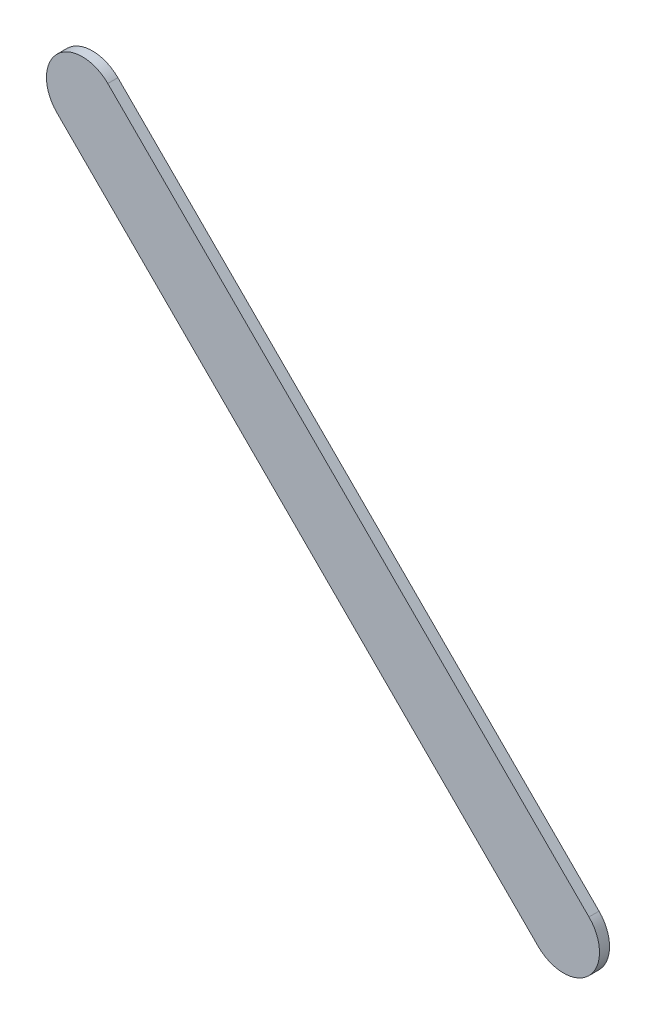
ISO-10303-21;
HEADER;
FILE_DESCRIPTION(('STEP AP214'),'2;1');
FILE_NAME('part.step','',(''),(''),'','','');
FILE_SCHEMA(('AUTOMOTIVE_DESIGN { 1 0 10303 214 1 1 1 1 }'));
ENDSEC;
DATA;
#1=APPLICATION_CONTEXT('core data for automotive mechanical design processes');
#2=APPLICATION_PROTOCOL_DEFINITION('international standard','automotive_design',2000,#1);
#3=PRODUCT_CONTEXT('',#1,'mechanical');
#4=PRODUCT('Part','Part','',(#3));
#5=PRODUCT_RELATED_PRODUCT_CATEGORY('part','',(#4));
#6=PRODUCT_DEFINITION_FORMATION('','',#4);
#7=PRODUCT_DEFINITION_CONTEXT('part definition',#1,'design');
#8=PRODUCT_DEFINITION('design','',#6,#7);
#9=PRODUCT_DEFINITION_SHAPE('','',#8);
#10=(LENGTH_UNIT() NAMED_UNIT(*) SI_UNIT(.MILLI.,.METRE.));
#11=(NAMED_UNIT(*) PLANE_ANGLE_UNIT() SI_UNIT($,.RADIAN.));
#12=(NAMED_UNIT(*) SI_UNIT($,.STERADIAN.) SOLID_ANGLE_UNIT());
#13=UNCERTAINTY_MEASURE_WITH_UNIT(LENGTH_MEASURE(1.E-05),#10,'distance_accuracy_value','');
#14=(GEOMETRIC_REPRESENTATION_CONTEXT(3) GLOBAL_UNCERTAINTY_ASSIGNED_CONTEXT((#13)) GLOBAL_UNIT_ASSIGNED_CONTEXT((#10,
#11,#12)) REPRESENTATION_CONTEXT('',''));
#15=CARTESIAN_POINT('',(0.,0.,0.));
#16=DIRECTION('',(0.,0.,1.));
#17=DIRECTION('',(1.,0.,0.));
#18=AXIS2_PLACEMENT_3D('',#15,#16,#17);
#19=CARTESIAN_POINT('',(98.3271719,97.59717082,0.));
#20=DIRECTION('',(0.707106781186548,0.707106781186548,0.));
#21=DIRECTION('',(0.707106781186548,-0.707106781186548,0.));
#22=AXIS2_PLACEMENT_3D('',#19,#20,#21);
#23=PLANE('',#22);
#24=DIRECTION('',(0.707106781186548,-0.707106781186548,0.));
#25=VECTOR('',#24,1.);
#26=CARTESIAN_POINT('',(98.3271719,97.59717082,0.03556));
#27=LINE('',#26,#25);
#28=CARTESIAN_POINT('',(98.3271719,97.59717082,0.03556));
#29=VERTEX_POINT('',#28);
#30=CARTESIAN_POINT('',(100.02717104,95.89717168,0.03556));
#31=VERTEX_POINT('',#30);
#32=EDGE_CURVE('E11',#29,#31,#27,.T.);
#33=ORIENTED_EDGE('',*,*,#32,.F.);
#34=DIRECTION('',(0.,0.,1.));
#35=VECTOR('',#34,1.);
#36=CARTESIAN_POINT('',(98.3271719,97.59717082,0.));
#37=LINE('',#36,#35);
#38=CARTESIAN_POINT('',(98.3271719,97.59717082,0.));
#39=VERTEX_POINT('',#38);
#40=EDGE_CURVE('E24',#39,#29,#37,.T.);
#41=ORIENTED_EDGE('',*,*,#40,.F.);
#42=DIRECTION('',(0.707106781186548,-0.707106781186548,0.));
#43=VECTOR('',#42,1.);
#44=CARTESIAN_POINT('',(98.3271719,97.59717082,0.));
#45=LINE('',#44,#43);
#46=CARTESIAN_POINT('',(100.02717104,95.89717168,0.));
#47=VERTEX_POINT('',#46);
#48=EDGE_CURVE('E75',#39,#47,#45,.T.);
#49=ORIENTED_EDGE('',*,*,#48,.T.);
#50=DIRECTION('',(0.,0.,1.));
#51=VECTOR('',#50,1.);
#52=CARTESIAN_POINT('',(100.02717104,95.89717168,0.));
#53=LINE('',#52,#51);
#54=EDGE_CURVE('E37',#47,#31,#53,.T.);
#55=ORIENTED_EDGE('',*,*,#54,.T.);
#56=EDGE_LOOP('',(#33,#41,#49,#55));
#57=FACE_BOUND('',#56,.T.);
#58=ADVANCED_FACE('F17',(#57),#23,.F.);
#59=CARTESIAN_POINT('',(100.11697274,95.98697465,0.));
#60=DIRECTION('',(0.,0.,-1.));
#61=DIRECTION('',(-0.707101781156225,-0.707111781181515,0.));
#62=AXIS2_PLACEMENT_3D('',#59,#60,#61);
#63=CYLINDRICAL_SURFACE('',#62,0.126999680092953);
#64=CARTESIAN_POINT('',(100.11697274,95.98697465,0.03556));
#65=DIRECTION('',(0.,0.,1.));
#66=DIRECTION('',(-0.707101781156225,-0.707111781181515,0.));
#67=AXIS2_PLACEMENT_3D('',#64,#65,#66);
#68=CIRCLE('',#67,0.126999680092953);
#69=CARTESIAN_POINT('',(100.20677444,96.07677762,0.03556));
#70=VERTEX_POINT('',#69);
#71=EDGE_CURVE('E83',#31,#70,#68,.T.);
#72=ORIENTED_EDGE('',*,*,#71,.F.);
#73=ORIENTED_EDGE('',*,*,#54,.F.);
#74=CARTESIAN_POINT('',(100.11697274,95.98697465,0.));
#75=DIRECTION('',(0.,0.,1.));
#76=DIRECTION('',(-0.707101781156225,-0.707111781181515,0.));
#77=AXIS2_PLACEMENT_3D('',#74,#75,#76);
#78=CIRCLE('',#77,0.126999680092953);
#79=CARTESIAN_POINT('',(100.20677444,96.07677762,0.));
#80=VERTEX_POINT('',#79);
#81=EDGE_CURVE('E81',#47,#80,#78,.T.);
#82=ORIENTED_EDGE('',*,*,#81,.T.);
#83=DIRECTION('',(0.,0.,1.));
#84=VECTOR('',#83,1.);
#85=CARTESIAN_POINT('',(100.20677444,96.07677762,0.));
#86=LINE('',#85,#84);
#87=EDGE_CURVE('E67',#80,#70,#86,.T.);
#88=ORIENTED_EDGE('',*,*,#87,.T.);
#89=EDGE_LOOP('',(#72,#73,#82,#88));
#90=FACE_BOUND('',#89,.T.);
#91=ADVANCED_FACE('F89',(#90),#63,.T.);
#92=CARTESIAN_POINT('',(100.20677444,96.07677762,0.));
#93=DIRECTION('',(-0.707106781186545,-0.707106781186551,0.));
#94=DIRECTION('',(-0.707106781186551,0.707106781186545,0.));
#95=AXIS2_PLACEMENT_3D('',#92,#93,#94);
#96=PLANE('',#95);
#97=DIRECTION('',(-0.707106781186551,0.707106781186545,0.));
#98=VECTOR('',#97,1.);
#99=CARTESIAN_POINT('',(100.20677444,96.07677762,0.03556));
#100=LINE('',#99,#98);
#101=CARTESIAN_POINT('',(98.50677784,97.77677422,0.03556));
#102=VERTEX_POINT('',#101);
#103=EDGE_CURVE('E71',#70,#102,#100,.T.);
#104=ORIENTED_EDGE('',*,*,#103,.F.);
#105=ORIENTED_EDGE('',*,*,#87,.F.);
#106=DIRECTION('',(-0.707106781186551,0.707106781186545,0.));
#107=VECTOR('',#106,1.);
#108=CARTESIAN_POINT('',(100.20677444,96.07677762,0.));
#109=LINE('',#108,#107);
#110=CARTESIAN_POINT('',(98.50677784,97.77677422,0.));
#111=VERTEX_POINT('',#110);
#112=EDGE_CURVE('E63',#80,#111,#109,.T.);
#113=ORIENTED_EDGE('',*,*,#112,.T.);
#114=DIRECTION('',(0.,0.,1.));
#115=VECTOR('',#114,1.);
#116=CARTESIAN_POINT('',(98.50677784,97.77677422,0.));
#117=LINE('',#116,#115);
#118=EDGE_CURVE('E53',#111,#102,#117,.T.);
#119=ORIENTED_EDGE('',*,*,#118,.T.);
#120=EDGE_LOOP('',(#104,#105,#113,#119));
#121=FACE_BOUND('',#120,.T.);
#122=ADVANCED_FACE('F66',(#121),#96,.F.);
#123=CARTESIAN_POINT('',(98.41697487,97.68697252,0.));
#124=DIRECTION('',(0.,0.,-1.));
#125=DIRECTION('',(0.707111781181515,0.707101781156225,0.));
#126=AXIS2_PLACEMENT_3D('',#123,#124,#125);
#127=CYLINDRICAL_SURFACE('',#126,0.126999680092943);
#128=CARTESIAN_POINT('',(98.41697487,97.68697252,0.03556));
#129=DIRECTION('',(0.,0.,1.));
#130=DIRECTION('',(0.707111781181515,0.707101781156225,0.));
#131=AXIS2_PLACEMENT_3D('',#128,#129,#130);
#132=CIRCLE('',#131,0.126999680092943);
#133=EDGE_CURVE('E59',#102,#29,#132,.T.);
#134=ORIENTED_EDGE('',*,*,#133,.F.);
#135=ORIENTED_EDGE('',*,*,#118,.F.);
#136=CARTESIAN_POINT('',(98.41697487,97.68697252,0.));
#137=DIRECTION('',(0.,0.,1.));
#138=DIRECTION('',(0.707111781181515,0.707101781156225,0.));
#139=AXIS2_PLACEMENT_3D('',#136,#137,#138);
#140=CIRCLE('',#139,0.126999680092943);
#141=EDGE_CURVE('E57',#111,#39,#140,.T.);
#142=ORIENTED_EDGE('',*,*,#141,.T.);
#143=ORIENTED_EDGE('',*,*,#40,.T.);
#144=EDGE_LOOP('',(#134,#135,#142,#143));
#145=FACE_BOUND('',#144,.T.);
#146=ADVANCED_FACE('F55',(#145),#127,.T.);
#147=CARTESIAN_POINT('',(98.3271719,97.59717082,0.));
#148=DIRECTION('',(0.,0.,-1.));
#149=DIRECTION('',(-1.,0.,0.));
#150=AXIS2_PLACEMENT_3D('',#147,#148,#149);
#151=PLANE('',#150);
#152=ORIENTED_EDGE('',*,*,#141,.F.);
#153=ORIENTED_EDGE('',*,*,#112,.F.);
#154=ORIENTED_EDGE('',*,*,#81,.F.);
#155=ORIENTED_EDGE('',*,*,#48,.F.);
#156=EDGE_LOOP('',(#152,#153,#154,#155));
#157=FACE_BOUND('',#156,.T.);
#158=ADVANCED_FACE('F74',(#157),#151,.T.);
#159=CARTESIAN_POINT('',(98.3271719,97.59717082,0.03556));
#160=DIRECTION('',(0.,0.,-1.));
#161=DIRECTION('',(-1.,0.,0.));
#162=AXIS2_PLACEMENT_3D('',#159,#160,#161);
#163=PLANE('',#162);
#164=ORIENTED_EDGE('',*,*,#32,.T.);
#165=ORIENTED_EDGE('',*,*,#71,.T.);
#166=ORIENTED_EDGE('',*,*,#103,.T.);
#167=ORIENTED_EDGE('',*,*,#133,.T.);
#168=EDGE_LOOP('',(#164,#165,#166,#167));
#169=FACE_BOUND('',#168,.T.);
#170=ADVANCED_FACE('F91',(#169),#163,.F.);
#171=CLOSED_SHELL('',(#58,#91,#122,#146,#158,#170));
#172=MANIFOLD_SOLID_BREP('B1',#171);
#173=ADVANCED_BREP_SHAPE_REPRESENTATION('',(#18,#172),#14);
#174=SHAPE_DEFINITION_REPRESENTATION(#9,#173);
ENDSEC;
END-ISO-10303-21;
